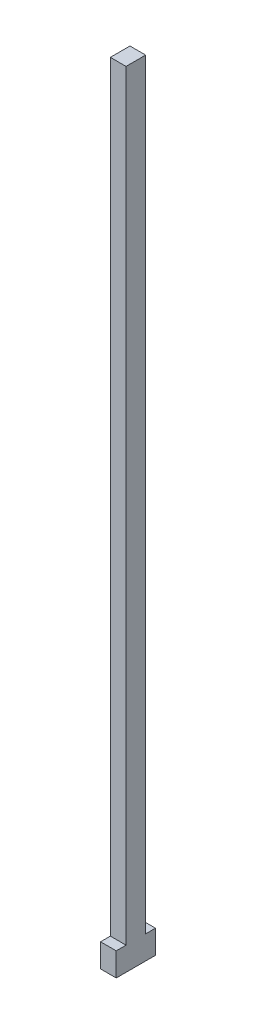
ISO-10303-21;
HEADER;
FILE_DESCRIPTION(('STEP AP214'),'2;1');
FILE_NAME('part.step','',(''),(''),'','','');
FILE_SCHEMA(('AUTOMOTIVE_DESIGN { 1 0 10303 214 1 1 1 1 }'));
ENDSEC;
DATA;
#1=APPLICATION_CONTEXT('core data for automotive mechanical design processes');
#2=APPLICATION_PROTOCOL_DEFINITION('international standard','automotive_design',2000,#1);
#3=PRODUCT_CONTEXT('',#1,'mechanical');
#4=PRODUCT('Part','Part','',(#3));
#5=PRODUCT_RELATED_PRODUCT_CATEGORY('part','',(#4));
#6=PRODUCT_DEFINITION_FORMATION('','',#4);
#7=PRODUCT_DEFINITION_CONTEXT('part definition',#1,'design');
#8=PRODUCT_DEFINITION('design','',#6,#7);
#9=PRODUCT_DEFINITION_SHAPE('','',#8);
#10=(LENGTH_UNIT() NAMED_UNIT(*) SI_UNIT(.MILLI.,.METRE.));
#11=(NAMED_UNIT(*) PLANE_ANGLE_UNIT() SI_UNIT($,.RADIAN.));
#12=(NAMED_UNIT(*) SI_UNIT($,.STERADIAN.) SOLID_ANGLE_UNIT());
#13=UNCERTAINTY_MEASURE_WITH_UNIT(LENGTH_MEASURE(1.E-05),#10,'distance_accuracy_value','');
#14=(GEOMETRIC_REPRESENTATION_CONTEXT(3) GLOBAL_UNCERTAINTY_ASSIGNED_CONTEXT((#13)) GLOBAL_UNIT_ASSIGNED_CONTEXT((#10,
#11,#12)) REPRESENTATION_CONTEXT('',''));
#15=CARTESIAN_POINT('',(0.,0.,0.));
#16=DIRECTION('',(0.,0.,1.));
#17=DIRECTION('',(1.,0.,0.));
#18=AXIS2_PLACEMENT_3D('',#15,#16,#17);
#19=CARTESIAN_POINT('',(-2.,6.,0.));
#20=DIRECTION('',(1.,0.,0.));
#21=DIRECTION('',(0.,0.,-1.));
#22=AXIS2_PLACEMENT_3D('',#19,#20,#21);
#23=PLANE('',#22);
#24=DIRECTION('',(0.,0.,1.));
#25=VECTOR('',#24,1.);
#26=CARTESIAN_POINT('',(-2.,0.,0.));
#27=LINE('',#26,#25);
#28=CARTESIAN_POINT('',(-2.,0.,-5.));
#29=VERTEX_POINT('',#28);
#30=CARTESIAN_POINT('',(-2.,0.,5.00109551680957));
#31=VERTEX_POINT('',#30);
#32=EDGE_CURVE('E177',#29,#31,#27,.T.);
#33=ORIENTED_EDGE('',*,*,#32,.T.);
#34=DIRECTION('',(0.,-1.,0.));
#35=VECTOR('',#34,1.);
#36=CARTESIAN_POINT('',(-2.,6.,5.00109551680957));
#37=LINE('',#36,#35);
#38=CARTESIAN_POINT('',(-2.,6.,5.00109551680957));
#39=VERTEX_POINT('',#38);
#40=EDGE_CURVE('E11',#39,#31,#37,.T.);
#41=ORIENTED_EDGE('',*,*,#40,.F.);
#42=DIRECTION('',(0.,0.,1.));
#43=VECTOR('',#42,1.);
#44=CARTESIAN_POINT('',(-2.,6.,0.));
#45=LINE('',#44,#43);
#46=CARTESIAN_POINT('',(-2.,6.,2.5));
#47=VERTEX_POINT('',#46);
#48=EDGE_CURVE('E82',#47,#39,#45,.T.);
#49=ORIENTED_EDGE('',*,*,#48,.F.);
#50=DIRECTION('',(0.,-1.,0.));
#51=VECTOR('',#50,1.);
#52=CARTESIAN_POINT('',(-2.,200.,2.5));
#53=LINE('',#52,#51);
#54=CARTESIAN_POINT('',(-2.,200.,2.5));
#55=VERTEX_POINT('',#54);
#56=EDGE_CURVE('E167',#55,#47,#53,.T.);
#57=ORIENTED_EDGE('',*,*,#56,.F.);
#58=DIRECTION('',(0.,0.,1.));
#59=VECTOR('',#58,1.);
#60=CARTESIAN_POINT('',(-2.,200.,0.));
#61=LINE('',#60,#59);
#62=CARTESIAN_POINT('',(-2.,200.,-2.5));
#63=VERTEX_POINT('',#62);
#64=EDGE_CURVE('E157',#63,#55,#61,.T.);
#65=ORIENTED_EDGE('',*,*,#64,.F.);
#66=DIRECTION('',(0.,-1.,0.));
#67=VECTOR('',#66,1.);
#68=CARTESIAN_POINT('',(-2.,200.,-2.5));
#69=LINE('',#68,#67);
#70=CARTESIAN_POINT('',(-2.,6.00000000000001,-2.5));
#71=VERTEX_POINT('',#70);
#72=EDGE_CURVE('E171',#63,#71,#69,.T.);
#73=ORIENTED_EDGE('',*,*,#72,.T.);
#74=DIRECTION('',(0.,0.,-1.));
#75=VECTOR('',#74,1.);
#76=CARTESIAN_POINT('',(-2.,6.,0.));
#77=LINE('',#76,#75);
#78=CARTESIAN_POINT('',(-2.,6.,-5.));
#79=VERTEX_POINT('',#78);
#80=EDGE_CURVE('E139',#71,#79,#77,.T.);
#81=ORIENTED_EDGE('',*,*,#80,.T.);
#82=DIRECTION('',(0.,-1.,0.));
#83=VECTOR('',#82,1.);
#84=CARTESIAN_POINT('',(-2.,6.,-5.));
#85=LINE('',#84,#83);
#86=EDGE_CURVE('E125',#79,#29,#85,.T.);
#87=ORIENTED_EDGE('',*,*,#86,.T.);
#88=EDGE_LOOP('',(#33,#41,#49,#57,#65,#73,#81,#87));
#89=FACE_BOUND('',#88,.T.);
#90=ADVANCED_FACE('F39',(#89),#23,.F.);
#91=CARTESIAN_POINT('',(0.,6.,5.00109551680957));
#92=DIRECTION('',(0.,0.,-1.));
#93=DIRECTION('',(-1.,0.,0.));
#94=AXIS2_PLACEMENT_3D('',#91,#92,#93);
#95=PLANE('',#94);
#96=DIRECTION('',(1.,0.,0.));
#97=VECTOR('',#96,1.);
#98=CARTESIAN_POINT('',(0.,0.,5.00109551680957));
#99=LINE('',#98,#97);
#100=CARTESIAN_POINT('',(2.,0.,5.00109551680957));
#101=VERTEX_POINT('',#100);
#102=EDGE_CURVE('E76',#31,#101,#99,.T.);
#103=ORIENTED_EDGE('',*,*,#102,.T.);
#104=DIRECTION('',(0.,-1.,0.));
#105=VECTOR('',#104,1.);
#106=CARTESIAN_POINT('',(2.,6.,5.00109551680957));
#107=LINE('',#106,#105);
#108=CARTESIAN_POINT('',(2.,6.,5.00109551680957));
#109=VERTEX_POINT('',#108);
#110=EDGE_CURVE('E47',#109,#101,#107,.T.);
#111=ORIENTED_EDGE('',*,*,#110,.F.);
#112=DIRECTION('',(1.,0.,0.));
#113=VECTOR('',#112,1.);
#114=CARTESIAN_POINT('',(0.,6.,5.00109551680957));
#115=LINE('',#114,#113);
#116=EDGE_CURVE('E63',#39,#109,#115,.T.);
#117=ORIENTED_EDGE('',*,*,#116,.F.);
#118=ORIENTED_EDGE('',*,*,#40,.T.);
#119=EDGE_LOOP('',(#103,#111,#117,#118));
#120=FACE_BOUND('',#119,.T.);
#121=ADVANCED_FACE('F209',(#120),#95,.F.);
#122=CARTESIAN_POINT('',(2.,6.,0.));
#123=DIRECTION('',(-1.,0.,0.));
#124=DIRECTION('',(0.,0.,1.));
#125=AXIS2_PLACEMENT_3D('',#122,#123,#124);
#126=PLANE('',#125);
#127=DIRECTION('',(0.,0.,-1.));
#128=VECTOR('',#127,1.);
#129=CARTESIAN_POINT('',(2.,0.,0.));
#130=LINE('',#129,#128);
#131=CARTESIAN_POINT('',(2.,0.,-5.));
#132=VERTEX_POINT('',#131);
#133=EDGE_CURVE('E118',#101,#132,#130,.T.);
#134=ORIENTED_EDGE('',*,*,#133,.T.);
#135=DIRECTION('',(0.,-1.,0.));
#136=VECTOR('',#135,1.);
#137=CARTESIAN_POINT('',(2.,6.,-5.));
#138=LINE('',#137,#136);
#139=CARTESIAN_POINT('',(2.,6.,-5.));
#140=VERTEX_POINT('',#139);
#141=EDGE_CURVE('E113',#140,#132,#138,.T.);
#142=ORIENTED_EDGE('',*,*,#141,.F.);
#143=DIRECTION('',(0.,0.,1.));
#144=VECTOR('',#143,1.);
#145=CARTESIAN_POINT('',(2.,6.,0.));
#146=LINE('',#145,#144);
#147=CARTESIAN_POINT('',(2.,6.,-2.5));
#148=VERTEX_POINT('',#147);
#149=EDGE_CURVE('E116',#140,#148,#146,.T.);
#150=ORIENTED_EDGE('',*,*,#149,.T.);
#151=DIRECTION('',(0.,-1.,0.));
#152=VECTOR('',#151,1.);
#153=CARTESIAN_POINT('',(2.,200.,-2.5));
#154=LINE('',#153,#152);
#155=CARTESIAN_POINT('',(2.,200.,-2.5));
#156=VERTEX_POINT('',#155);
#157=EDGE_CURVE('E174',#156,#148,#154,.T.);
#158=ORIENTED_EDGE('',*,*,#157,.F.);
#159=DIRECTION('',(0.,0.,1.));
#160=VECTOR('',#159,1.);
#161=CARTESIAN_POINT('',(2.,200.,0.));
#162=LINE('',#161,#160);
#163=CARTESIAN_POINT('',(2.,200.,2.5));
#164=VERTEX_POINT('',#163);
#165=EDGE_CURVE('E124',#156,#164,#162,.T.);
#166=ORIENTED_EDGE('',*,*,#165,.T.);
#167=DIRECTION('',(0.,-1.,0.));
#168=VECTOR('',#167,1.);
#169=CARTESIAN_POINT('',(2.,200.,2.5));
#170=LINE('',#169,#168);
#171=CARTESIAN_POINT('',(2.,6.00000000000001,2.5));
#172=VERTEX_POINT('',#171);
#173=EDGE_CURVE('E163',#164,#172,#170,.T.);
#174=ORIENTED_EDGE('',*,*,#173,.T.);
#175=DIRECTION('',(0.,0.,-1.));
#176=VECTOR('',#175,1.);
#177=CARTESIAN_POINT('',(2.,6.,0.));
#178=LINE('',#177,#176);
#179=EDGE_CURVE('E186',#109,#172,#178,.T.);
#180=ORIENTED_EDGE('',*,*,#179,.F.);
#181=ORIENTED_EDGE('',*,*,#110,.T.);
#182=EDGE_LOOP('',(#134,#142,#150,#158,#166,#174,#180,#181));
#183=FACE_BOUND('',#182,.T.);
#184=ADVANCED_FACE('F115',(#183),#126,.F.);
#185=CARTESIAN_POINT('',(0.,6.,0.));
#186=DIRECTION('',(0.,1.,0.));
#187=DIRECTION('',(0.,0.,1.));
#188=AXIS2_PLACEMENT_3D('',#185,#186,#187);
#189=PLANE('',#188);
#190=DIRECTION('',(1.,0.,0.));
#191=VECTOR('',#190,1.);
#192=CARTESIAN_POINT('',(0.,6.,2.5));
#193=LINE('',#192,#191);
#194=EDGE_CURVE('E178',#47,#172,#193,.T.);
#195=ORIENTED_EDGE('',*,*,#194,.F.);
#196=ORIENTED_EDGE('',*,*,#48,.T.);
#197=ORIENTED_EDGE('',*,*,#116,.T.);
#198=ORIENTED_EDGE('',*,*,#179,.T.);
#199=EDGE_LOOP('',(#195,#196,#197,#198));
#200=FACE_BOUND('',#199,.T.);
#201=ADVANCED_FACE('F208',(#200),#189,.T.);
#202=CARTESIAN_POINT('',(0.,0.,0.));
#203=DIRECTION('',(0.,1.,0.));
#204=DIRECTION('',(0.,0.,1.));
#205=AXIS2_PLACEMENT_3D('',#202,#203,#204);
#206=PLANE('',#205);
#207=ORIENTED_EDGE('',*,*,#32,.F.);
#208=DIRECTION('',(1.,0.,0.));
#209=VECTOR('',#208,1.);
#210=CARTESIAN_POINT('',(0.,0.,-5.));
#211=LINE('',#210,#209);
#212=EDGE_CURVE('E134',#29,#132,#211,.T.);
#213=ORIENTED_EDGE('',*,*,#212,.T.);
#214=ORIENTED_EDGE('',*,*,#133,.F.);
#215=ORIENTED_EDGE('',*,*,#102,.F.);
#216=EDGE_LOOP('',(#207,#213,#214,#215));
#217=FACE_BOUND('',#216,.T.);
#218=ADVANCED_FACE('F197',(#217),#206,.F.);
#219=CARTESIAN_POINT('',(0.,200.,2.5));
#220=DIRECTION('',(0.,0.,-1.));
#221=DIRECTION('',(-1.,0.,0.));
#222=AXIS2_PLACEMENT_3D('',#219,#220,#221);
#223=PLANE('',#222);
#224=ORIENTED_EDGE('',*,*,#56,.T.);
#225=ORIENTED_EDGE('',*,*,#194,.T.);
#226=ORIENTED_EDGE('',*,*,#173,.F.);
#227=DIRECTION('',(1.,0.,0.));
#228=VECTOR('',#227,1.);
#229=CARTESIAN_POINT('',(0.,200.,2.5));
#230=LINE('',#229,#228);
#231=EDGE_CURVE('E160',#55,#164,#230,.T.);
#232=ORIENTED_EDGE('',*,*,#231,.F.);
#233=EDGE_LOOP('',(#224,#225,#226,#232));
#234=FACE_BOUND('',#233,.T.);
#235=ADVANCED_FACE('F207',(#234),#223,.F.);
#236=CARTESIAN_POINT('',(0.,200.,-2.5));
#237=DIRECTION('',(0.,0.,-1.));
#238=DIRECTION('',(-1.,0.,0.));
#239=AXIS2_PLACEMENT_3D('',#236,#237,#238);
#240=PLANE('',#239);
#241=DIRECTION('',(1.,0.,0.));
#242=VECTOR('',#241,1.);
#243=CARTESIAN_POINT('',(0.,6.,-2.5));
#244=LINE('',#243,#242);
#245=EDGE_CURVE('E54',#71,#148,#244,.T.);
#246=ORIENTED_EDGE('',*,*,#245,.F.);
#247=ORIENTED_EDGE('',*,*,#72,.F.);
#248=DIRECTION('',(1.,0.,0.));
#249=VECTOR('',#248,1.);
#250=CARTESIAN_POINT('',(0.,200.,-2.5));
#251=LINE('',#250,#249);
#252=EDGE_CURVE('E153',#63,#156,#251,.T.);
#253=ORIENTED_EDGE('',*,*,#252,.T.);
#254=ORIENTED_EDGE('',*,*,#157,.T.);
#255=EDGE_LOOP('',(#246,#247,#253,#254));
#256=FACE_BOUND('',#255,.T.);
#257=ADVANCED_FACE('F200',(#256),#240,.T.);
#258=CARTESIAN_POINT('',(0.,200.,0.));
#259=DIRECTION('',(0.,1.,0.));
#260=DIRECTION('',(0.,0.,1.));
#261=AXIS2_PLACEMENT_3D('',#258,#259,#260);
#262=PLANE('',#261);
#263=ORIENTED_EDGE('',*,*,#165,.F.);
#264=ORIENTED_EDGE('',*,*,#252,.F.);
#265=ORIENTED_EDGE('',*,*,#64,.T.);
#266=ORIENTED_EDGE('',*,*,#231,.T.);
#267=EDGE_LOOP('',(#263,#264,#265,#266));
#268=FACE_BOUND('',#267,.T.);
#269=ADVANCED_FACE('F203',(#268),#262,.T.);
#270=CARTESIAN_POINT('',(0.,6.,-5.));
#271=DIRECTION('',(0.,0.,-1.));
#272=DIRECTION('',(-1.,0.,0.));
#273=AXIS2_PLACEMENT_3D('',#270,#271,#272);
#274=PLANE('',#273);
#275=ORIENTED_EDGE('',*,*,#212,.F.);
#276=ORIENTED_EDGE('',*,*,#86,.F.);
#277=DIRECTION('',(1.,0.,0.));
#278=VECTOR('',#277,1.);
#279=CARTESIAN_POINT('',(0.,6.,-5.));
#280=LINE('',#279,#278);
#281=EDGE_CURVE('E131',#79,#140,#280,.T.);
#282=ORIENTED_EDGE('',*,*,#281,.T.);
#283=ORIENTED_EDGE('',*,*,#141,.T.);
#284=EDGE_LOOP('',(#275,#276,#282,#283));
#285=FACE_BOUND('',#284,.T.);
#286=ADVANCED_FACE('F136',(#285),#274,.T.);
#287=CARTESIAN_POINT('',(0.,6.,0.));
#288=DIRECTION('',(0.,1.,0.));
#289=DIRECTION('',(0.,0.,1.));
#290=AXIS2_PLACEMENT_3D('',#287,#288,#289);
#291=PLANE('',#290);
#292=ORIENTED_EDGE('',*,*,#149,.F.);
#293=ORIENTED_EDGE('',*,*,#281,.F.);
#294=ORIENTED_EDGE('',*,*,#80,.F.);
#295=ORIENTED_EDGE('',*,*,#245,.T.);
#296=EDGE_LOOP('',(#292,#293,#294,#295));
#297=FACE_BOUND('',#296,.T.);
#298=ADVANCED_FACE('F129',(#297),#291,.T.);
#299=CLOSED_SHELL('',(#90,#121,#184,#201,#218,#235,#257,#269,#286,#298));
#300=MANIFOLD_SOLID_BREP('B2',#299);
#301=ADVANCED_BREP_SHAPE_REPRESENTATION('',(#18,#300),#14);
#302=SHAPE_DEFINITION_REPRESENTATION(#9,#301);
ENDSEC;
END-ISO-10303-21;
